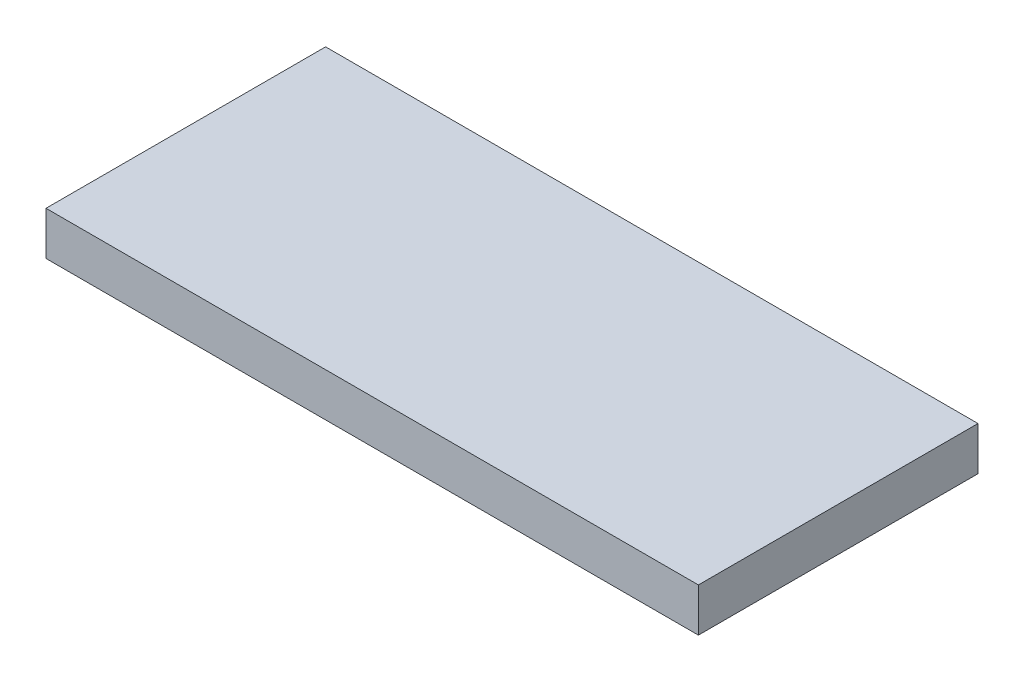
ISO-10303-21;
HEADER;
FILE_DESCRIPTION(('STEP AP214'),'2;1');
FILE_NAME('part.step','',(''),(''),'','','');
FILE_SCHEMA(('AUTOMOTIVE_DESIGN { 1 0 10303 214 1 1 1 1 }'));
ENDSEC;
DATA;
#1=APPLICATION_CONTEXT('core data for automotive mechanical design processes');
#2=APPLICATION_PROTOCOL_DEFINITION('international standard','automotive_design',2000,#1);
#3=PRODUCT_CONTEXT('',#1,'mechanical');
#4=PRODUCT('Part','Part','',(#3));
#5=PRODUCT_RELATED_PRODUCT_CATEGORY('part','',(#4));
#6=PRODUCT_DEFINITION_FORMATION('','',#4);
#7=PRODUCT_DEFINITION_CONTEXT('part definition',#1,'design');
#8=PRODUCT_DEFINITION('design','',#6,#7);
#9=PRODUCT_DEFINITION_SHAPE('','',#8);
#10=(LENGTH_UNIT() NAMED_UNIT(*) SI_UNIT(.MILLI.,.METRE.));
#11=(NAMED_UNIT(*) PLANE_ANGLE_UNIT() SI_UNIT($,.RADIAN.));
#12=(NAMED_UNIT(*) SI_UNIT($,.STERADIAN.) SOLID_ANGLE_UNIT());
#13=UNCERTAINTY_MEASURE_WITH_UNIT(LENGTH_MEASURE(1.E-05),#10,'distance_accuracy_value','');
#14=(GEOMETRIC_REPRESENTATION_CONTEXT(3) GLOBAL_UNCERTAINTY_ASSIGNED_CONTEXT((#13)) GLOBAL_UNIT_ASSIGNED_CONTEXT((#10,
#11,#12)) REPRESENTATION_CONTEXT('',''));
#15=CARTESIAN_POINT('',(0.,0.,0.));
#16=DIRECTION('',(0.,0.,1.));
#17=DIRECTION('',(1.,0.,0.));
#18=AXIS2_PLACEMENT_3D('',#15,#16,#17);
#19=CARTESIAN_POINT('',(0.,10.,0.));
#20=DIRECTION('',(1.,0.,0.));
#21=DIRECTION('',(0.,0.,-1.));
#22=AXIS2_PLACEMENT_3D('',#19,#20,#21);
#23=PLANE('',#22);
#24=DIRECTION('',(0.,0.,1.));
#25=VECTOR('',#24,1.);
#26=CARTESIAN_POINT('',(0.,0.,0.));
#27=LINE('',#26,#25);
#28=CARTESIAN_POINT('',(0.,0.,-64.2857142857143));
#29=VERTEX_POINT('',#28);
#30=CARTESIAN_POINT('',(0.,0.,0.));
#31=VERTEX_POINT('',#30);
#32=EDGE_CURVE('E106',#29,#31,#27,.T.);
#33=ORIENTED_EDGE('',*,*,#32,.T.);
#34=DIRECTION('',(0.,-1.,0.));
#35=VECTOR('',#34,1.);
#36=CARTESIAN_POINT('',(0.,10.,0.));
#37=LINE('',#36,#35);
#38=CARTESIAN_POINT('',(0.,10.,0.));
#39=VERTEX_POINT('',#38);
#40=EDGE_CURVE('E11',#39,#31,#37,.T.);
#41=ORIENTED_EDGE('',*,*,#40,.F.);
#42=DIRECTION('',(0.,0.,1.));
#43=VECTOR('',#42,1.);
#44=CARTESIAN_POINT('',(0.,10.,0.));
#45=LINE('',#44,#43);
#46=CARTESIAN_POINT('',(0.,10.,-64.2857142857143));
#47=VERTEX_POINT('',#46);
#48=EDGE_CURVE('E89',#47,#39,#45,.T.);
#49=ORIENTED_EDGE('',*,*,#48,.F.);
#50=DIRECTION('',(0.,-1.,0.));
#51=VECTOR('',#50,1.);
#52=CARTESIAN_POINT('',(0.,10.,-64.2857142857143));
#53=LINE('',#52,#51);
#54=EDGE_CURVE('E102',#47,#29,#53,.T.);
#55=ORIENTED_EDGE('',*,*,#54,.T.);
#56=EDGE_LOOP('',(#33,#41,#49,#55));
#57=FACE_BOUND('',#56,.T.);
#58=ADVANCED_FACE('F37',(#57),#23,.F.);
#59=CARTESIAN_POINT('',(0.,10.,0.));
#60=DIRECTION('',(0.,0.,-1.));
#61=DIRECTION('',(-1.,0.,0.));
#62=AXIS2_PLACEMENT_3D('',#59,#60,#61);
#63=PLANE('',#62);
#64=DIRECTION('',(1.,0.,0.));
#65=VECTOR('',#64,1.);
#66=CARTESIAN_POINT('',(0.,0.,0.));
#67=LINE('',#66,#65);
#68=CARTESIAN_POINT('',(150.,0.,0.));
#69=VERTEX_POINT('',#68);
#70=EDGE_CURVE('E94',#31,#69,#67,.T.);
#71=ORIENTED_EDGE('',*,*,#70,.T.);
#72=DIRECTION('',(0.,-1.,0.));
#73=VECTOR('',#72,1.);
#74=CARTESIAN_POINT('',(150.,10.,0.));
#75=LINE('',#74,#73);
#76=CARTESIAN_POINT('',(150.,10.,0.));
#77=VERTEX_POINT('',#76);
#78=EDGE_CURVE('E46',#77,#69,#75,.T.);
#79=ORIENTED_EDGE('',*,*,#78,.F.);
#80=DIRECTION('',(1.,0.,0.));
#81=VECTOR('',#80,1.);
#82=CARTESIAN_POINT('',(0.,10.,0.));
#83=LINE('',#82,#81);
#84=EDGE_CURVE('E84',#39,#77,#83,.T.);
#85=ORIENTED_EDGE('',*,*,#84,.F.);
#86=ORIENTED_EDGE('',*,*,#40,.T.);
#87=EDGE_LOOP('',(#71,#79,#85,#86));
#88=FACE_BOUND('',#87,.T.);
#89=ADVANCED_FACE('F93',(#88),#63,.F.);
#90=CARTESIAN_POINT('',(150.,10.,0.));
#91=DIRECTION('',(-1.,0.,0.));
#92=DIRECTION('',(0.,0.,1.));
#93=AXIS2_PLACEMENT_3D('',#90,#91,#92);
#94=PLANE('',#93);
#95=DIRECTION('',(0.,0.,-1.));
#96=VECTOR('',#95,1.);
#97=CARTESIAN_POINT('',(150.,0.,0.));
#98=LINE('',#97,#96);
#99=CARTESIAN_POINT('',(150.,0.,-64.2857142857143));
#100=VERTEX_POINT('',#99);
#101=EDGE_CURVE('E71',#69,#100,#98,.T.);
#102=ORIENTED_EDGE('',*,*,#101,.T.);
#103=DIRECTION('',(0.,-1.,0.));
#104=VECTOR('',#103,1.);
#105=CARTESIAN_POINT('',(150.,10.,-64.2857142857143));
#106=LINE('',#105,#104);
#107=CARTESIAN_POINT('',(150.,10.,-64.2857142857143));
#108=VERTEX_POINT('',#107);
#109=EDGE_CURVE('E96',#108,#100,#106,.T.);
#110=ORIENTED_EDGE('',*,*,#109,.F.);
#111=DIRECTION('',(0.,0.,-1.));
#112=VECTOR('',#111,1.);
#113=CARTESIAN_POINT('',(150.,10.,0.));
#114=LINE('',#113,#112);
#115=EDGE_CURVE('E87',#77,#108,#114,.T.);
#116=ORIENTED_EDGE('',*,*,#115,.F.);
#117=ORIENTED_EDGE('',*,*,#78,.T.);
#118=EDGE_LOOP('',(#102,#110,#116,#117));
#119=FACE_BOUND('',#118,.T.);
#120=ADVANCED_FACE('F97',(#119),#94,.F.);
#121=CARTESIAN_POINT('',(0.,10.,-64.2857142857143));
#122=DIRECTION('',(0.,0.,1.));
#123=DIRECTION('',(1.,0.,0.));
#124=AXIS2_PLACEMENT_3D('',#121,#122,#123);
#125=PLANE('',#124);
#126=DIRECTION('',(-1.,0.,0.));
#127=VECTOR('',#126,1.);
#128=CARTESIAN_POINT('',(0.,0.,-64.2857142857143));
#129=LINE('',#128,#127);
#130=EDGE_CURVE('E77',#100,#29,#129,.T.);
#131=ORIENTED_EDGE('',*,*,#130,.T.);
#132=ORIENTED_EDGE('',*,*,#54,.F.);
#133=DIRECTION('',(-1.,0.,0.));
#134=VECTOR('',#133,1.);
#135=CARTESIAN_POINT('',(0.,10.,-64.2857142857143));
#136=LINE('',#135,#134);
#137=EDGE_CURVE('E54',#108,#47,#136,.T.);
#138=ORIENTED_EDGE('',*,*,#137,.F.);
#139=ORIENTED_EDGE('',*,*,#109,.T.);
#140=EDGE_LOOP('',(#131,#132,#138,#139));
#141=FACE_BOUND('',#140,.T.);
#142=ADVANCED_FACE('F120',(#141),#125,.F.);
#143=CARTESIAN_POINT('',(0.,10.,0.));
#144=DIRECTION('',(0.,-1.,0.));
#145=DIRECTION('',(0.,0.,-1.));
#146=AXIS2_PLACEMENT_3D('',#143,#144,#145);
#147=PLANE('',#146);
#148=ORIENTED_EDGE('',*,*,#48,.T.);
#149=ORIENTED_EDGE('',*,*,#84,.T.);
#150=ORIENTED_EDGE('',*,*,#115,.T.);
#151=ORIENTED_EDGE('',*,*,#137,.T.);
#152=EDGE_LOOP('',(#148,#149,#150,#151));
#153=FACE_BOUND('',#152,.T.);
#154=ADVANCED_FACE('F85',(#153),#147,.F.);
#155=CARTESIAN_POINT('',(0.,0.,0.));
#156=DIRECTION('',(0.,-1.,0.));
#157=DIRECTION('',(0.,0.,-1.));
#158=AXIS2_PLACEMENT_3D('',#155,#156,#157);
#159=PLANE('',#158);
#160=ORIENTED_EDGE('',*,*,#32,.F.);
#161=ORIENTED_EDGE('',*,*,#130,.F.);
#162=ORIENTED_EDGE('',*,*,#101,.F.);
#163=ORIENTED_EDGE('',*,*,#70,.F.);
#164=EDGE_LOOP('',(#160,#161,#162,#163));
#165=FACE_BOUND('',#164,.T.);
#166=ADVANCED_FACE('F123',(#165),#159,.T.);
#167=CLOSED_SHELL('',(#58,#89,#120,#142,#154,#166));
#168=MANIFOLD_SOLID_BREP('B2',#167);
#169=ADVANCED_BREP_SHAPE_REPRESENTATION('',(#18,#168),#14);
#170=SHAPE_DEFINITION_REPRESENTATION(#9,#169);
ENDSEC;
END-ISO-10303-21;
